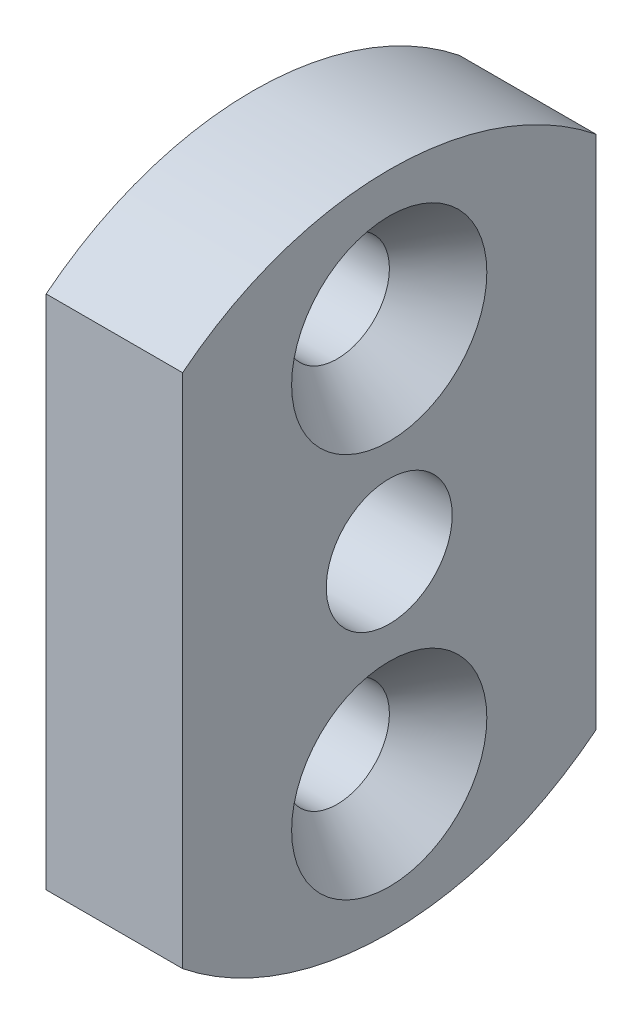
ISO-10303-21;
HEADER;
FILE_DESCRIPTION(('STEP AP214'),'2;1');
FILE_NAME('part.step','',(''),(''),'','','');
FILE_SCHEMA(('AUTOMOTIVE_DESIGN { 1 0 10303 214 1 1 1 1 }'));
ENDSEC;
DATA;
#1=APPLICATION_CONTEXT('core data for automotive mechanical design processes');
#2=APPLICATION_PROTOCOL_DEFINITION('international standard','automotive_design',2000,#1);
#3=PRODUCT_CONTEXT('',#1,'mechanical');
#4=PRODUCT('Part','Part','',(#3));
#5=PRODUCT_RELATED_PRODUCT_CATEGORY('part','',(#4));
#6=PRODUCT_DEFINITION_FORMATION('','',#4);
#7=PRODUCT_DEFINITION_CONTEXT('part definition',#1,'design');
#8=PRODUCT_DEFINITION('design','',#6,#7);
#9=PRODUCT_DEFINITION_SHAPE('','',#8);
#10=(LENGTH_UNIT() NAMED_UNIT(*) SI_UNIT(.MILLI.,.METRE.));
#11=(NAMED_UNIT(*) PLANE_ANGLE_UNIT() SI_UNIT($,.RADIAN.));
#12=(NAMED_UNIT(*) SI_UNIT($,.STERADIAN.) SOLID_ANGLE_UNIT());
#13=UNCERTAINTY_MEASURE_WITH_UNIT(LENGTH_MEASURE(1.E-05),#10,'distance_accuracy_value','');
#14=(GEOMETRIC_REPRESENTATION_CONTEXT(3) GLOBAL_UNCERTAINTY_ASSIGNED_CONTEXT((#13)) GLOBAL_UNIT_ASSIGNED_CONTEXT((#10,
#11,#12)) REPRESENTATION_CONTEXT('',''));
#15=CARTESIAN_POINT('',(0.,0.,0.));
#16=DIRECTION('',(0.,0.,1.));
#17=DIRECTION('',(1.,0.,0.));
#18=AXIS2_PLACEMENT_3D('',#15,#16,#17);
#19=CARTESIAN_POINT('',(4.953,0.,0.));
#20=DIRECTION('',(-1.,0.,0.));
#21=DIRECTION('',(0.,0.,1.));
#22=AXIS2_PLACEMENT_3D('',#19,#20,#21);
#23=PLANE('',#22);
#24=CARTESIAN_POINT('',(4.953,-7.,0.));
#25=DIRECTION('',(1.,0.,0.));
#26=DIRECTION('',(0.,0.,-1.));
#27=AXIS2_PLACEMENT_3D('',#24,#25,#26);
#28=CIRCLE('',#27,3.5433);
#29=CARTESIAN_POINT('',(4.953,-7.,-3.5433));
#30=VERTEX_POINT('',#29);
#31=EDGE_CURVE('E185',#30,#30,#28,.T.);
#32=ORIENTED_EDGE('',*,*,#31,.F.);
#33=EDGE_LOOP('',(#32));
#34=FACE_BOUND('',#33,.T.);
#35=CARTESIAN_POINT('',(4.953,7.,0.));
#36=DIRECTION('',(1.,0.,0.));
#37=DIRECTION('',(0.,0.,-1.));
#38=AXIS2_PLACEMENT_3D('',#35,#36,#37);
#39=CIRCLE('',#38,3.5433);
#40=CARTESIAN_POINT('',(4.953,7.,-3.5433));
#41=VERTEX_POINT('',#40);
#42=EDGE_CURVE('E117',#41,#41,#39,.T.);
#43=ORIENTED_EDGE('',*,*,#42,.F.);
#44=EDGE_LOOP('',(#43));
#45=FACE_BOUND('',#44,.T.);
#46=CARTESIAN_POINT('',(4.953,0.,0.));
#47=DIRECTION('',(1.,0.,0.));
#48=DIRECTION('',(0.,0.,1.));
#49=AXIS2_PLACEMENT_3D('',#46,#47,#48);
#50=CIRCLE('',#49,12.);
#51=CARTESIAN_POINT('',(4.953,9.3674969975976,-7.5));
#52=VERTEX_POINT('',#51);
#53=CARTESIAN_POINT('',(4.953,9.3674969975976,7.5));
#54=VERTEX_POINT('',#53);
#55=EDGE_CURVE('E87',#52,#54,#50,.T.);
#56=ORIENTED_EDGE('',*,*,#55,.T.);
#57=DIRECTION('',(0.,-1.,0.));
#58=VECTOR('',#57,1.);
#59=CARTESIAN_POINT('',(4.953,9.3674969975976,7.5));
#60=LINE('',#59,#58);
#61=CARTESIAN_POINT('',(4.953,-9.3674969975976,7.5));
#62=VERTEX_POINT('',#61);
#63=EDGE_CURVE('E82',#54,#62,#60,.T.);
#64=ORIENTED_EDGE('',*,*,#63,.T.);
#65=CARTESIAN_POINT('',(4.953,0.,0.));
#66=DIRECTION('',(1.,0.,0.));
#67=DIRECTION('',(0.,0.,-1.));
#68=AXIS2_PLACEMENT_3D('',#65,#66,#67);
#69=CIRCLE('',#68,12.);
#70=CARTESIAN_POINT('',(4.953,-9.3674969975976,-7.5));
#71=VERTEX_POINT('',#70);
#72=EDGE_CURVE('E85',#62,#71,#69,.T.);
#73=ORIENTED_EDGE('',*,*,#72,.T.);
#74=DIRECTION('',(0.,1.,0.));
#75=VECTOR('',#74,1.);
#76=CARTESIAN_POINT('',(4.953,9.3674969975976,-7.5));
#77=LINE('',#76,#75);
#78=EDGE_CURVE('E52',#71,#52,#77,.T.);
#79=ORIENTED_EDGE('',*,*,#78,.T.);
#80=EDGE_LOOP('',(#56,#64,#73,#79));
#81=FACE_BOUND('',#80,.T.);
#82=CARTESIAN_POINT('',(4.953,0.,0.));
#83=DIRECTION('',(1.,0.,0.));
#84=DIRECTION('',(0.,0.,-1.));
#85=AXIS2_PLACEMENT_3D('',#82,#83,#84);
#86=CIRCLE('',#85,2.286);
#87=CARTESIAN_POINT('',(4.953,0.,-2.286));
#88=VERTEX_POINT('',#87);
#89=EDGE_CURVE('E103',#88,#88,#86,.T.);
#90=ORIENTED_EDGE('',*,*,#89,.F.);
#91=EDGE_LOOP('',(#90));
#92=FACE_BOUND('',#91,.T.);
#93=ADVANCED_FACE('F33',(#34,#45,#81,#92),#23,.F.);
#94=CARTESIAN_POINT('',(0.,0.,0.));
#95=DIRECTION('',(-1.,0.,0.));
#96=DIRECTION('',(0.,0.,1.));
#97=AXIS2_PLACEMENT_3D('',#94,#95,#96);
#98=PLANE('',#97);
#99=CARTESIAN_POINT('',(0.,-7.,0.));
#100=DIRECTION('',(-1.,0.,0.));
#101=DIRECTION('',(0.,0.,1.));
#102=AXIS2_PLACEMENT_3D('',#99,#100,#101);
#103=CIRCLE('',#102,1.89865);
#104=CARTESIAN_POINT('',(0.,-7.,1.89865));
#105=VERTEX_POINT('',#104);
#106=EDGE_CURVE('E37',#105,#105,#103,.T.);
#107=ORIENTED_EDGE('',*,*,#106,.F.);
#108=EDGE_LOOP('',(#107));
#109=FACE_BOUND('',#108,.T.);
#110=CARTESIAN_POINT('',(0.,7.,0.));
#111=DIRECTION('',(-1.,0.,0.));
#112=DIRECTION('',(0.,0.,1.));
#113=AXIS2_PLACEMENT_3D('',#110,#111,#112);
#114=CIRCLE('',#113,1.89865);
#115=CARTESIAN_POINT('',(0.,7.,1.89865));
#116=VERTEX_POINT('',#115);
#117=EDGE_CURVE('E108',#116,#116,#114,.T.);
#118=ORIENTED_EDGE('',*,*,#117,.F.);
#119=EDGE_LOOP('',(#118));
#120=FACE_BOUND('',#119,.T.);
#121=CARTESIAN_POINT('',(0.,0.,0.));
#122=DIRECTION('',(1.,0.,0.));
#123=DIRECTION('',(0.,0.,1.));
#124=AXIS2_PLACEMENT_3D('',#121,#122,#123);
#125=CIRCLE('',#124,12.);
#126=CARTESIAN_POINT('',(0.,9.3674969975976,-7.5));
#127=VERTEX_POINT('',#126);
#128=CARTESIAN_POINT('',(0.,9.3674969975976,7.5));
#129=VERTEX_POINT('',#128);
#130=EDGE_CURVE('E100',#127,#129,#125,.T.);
#131=ORIENTED_EDGE('',*,*,#130,.F.);
#132=DIRECTION('',(0.,1.,0.));
#133=VECTOR('',#132,1.);
#134=CARTESIAN_POINT('',(0.,9.3674969975976,-7.5));
#135=LINE('',#134,#133);
#136=CARTESIAN_POINT('',(0.,-9.3674969975976,-7.5));
#137=VERTEX_POINT('',#136);
#138=EDGE_CURVE('E75',#137,#127,#135,.T.);
#139=ORIENTED_EDGE('',*,*,#138,.F.);
#140=CARTESIAN_POINT('',(0.,0.,0.));
#141=DIRECTION('',(1.,0.,0.));
#142=DIRECTION('',(0.,0.,-1.));
#143=AXIS2_PLACEMENT_3D('',#140,#141,#142);
#144=CIRCLE('',#143,12.);
#145=CARTESIAN_POINT('',(0.,-9.3674969975976,7.5));
#146=VERTEX_POINT('',#145);
#147=EDGE_CURVE('E69',#146,#137,#144,.T.);
#148=ORIENTED_EDGE('',*,*,#147,.F.);
#149=DIRECTION('',(0.,-1.,0.));
#150=VECTOR('',#149,1.);
#151=CARTESIAN_POINT('',(0.,9.3674969975976,7.5));
#152=LINE('',#151,#150);
#153=EDGE_CURVE('E91',#129,#146,#152,.T.);
#154=ORIENTED_EDGE('',*,*,#153,.F.);
#155=EDGE_LOOP('',(#131,#139,#148,#154));
#156=FACE_BOUND('',#155,.T.);
#157=CARTESIAN_POINT('',(0.,0.,0.));
#158=DIRECTION('',(1.,0.,0.));
#159=DIRECTION('',(0.,0.,-1.));
#160=AXIS2_PLACEMENT_3D('',#157,#158,#159);
#161=CIRCLE('',#160,2.286);
#162=CARTESIAN_POINT('',(0.,0.,-2.286));
#163=VERTEX_POINT('',#162);
#164=EDGE_CURVE('E110',#163,#163,#161,.T.);
#165=ORIENTED_EDGE('',*,*,#164,.T.);
#166=EDGE_LOOP('',(#165));
#167=FACE_BOUND('',#166,.T.);
#168=ADVANCED_FACE('F131',(#109,#120,#156,#167),#98,.T.);
#169=CARTESIAN_POINT('',(4.953,0.,0.));
#170=DIRECTION('',(-1.,0.,0.));
#171=DIRECTION('',(0.,0.,1.));
#172=AXIS2_PLACEMENT_3D('',#169,#170,#171);
#173=CYLINDRICAL_SURFACE('',#172,12.);
#174=ORIENTED_EDGE('',*,*,#130,.T.);
#175=DIRECTION('',(-1.,0.,0.));
#176=VECTOR('',#175,1.);
#177=CARTESIAN_POINT('',(4.953,9.3674969975976,7.5));
#178=LINE('',#177,#176);
#179=EDGE_CURVE('E11',#54,#129,#178,.T.);
#180=ORIENTED_EDGE('',*,*,#179,.F.);
#181=ORIENTED_EDGE('',*,*,#55,.F.);
#182=DIRECTION('',(-1.,0.,0.));
#183=VECTOR('',#182,1.);
#184=CARTESIAN_POINT('',(4.953,9.3674969975976,-7.5));
#185=LINE('',#184,#183);
#186=EDGE_CURVE('E96',#52,#127,#185,.T.);
#187=ORIENTED_EDGE('',*,*,#186,.T.);
#188=EDGE_LOOP('',(#174,#180,#181,#187));
#189=FACE_BOUND('',#188,.T.);
#190=ADVANCED_FACE('F35',(#189),#173,.T.);
#191=CARTESIAN_POINT('',(4.953,9.3674969975976,7.5));
#192=DIRECTION('',(0.,0.,-1.));
#193=DIRECTION('',(-1.,0.,0.));
#194=AXIS2_PLACEMENT_3D('',#191,#192,#193);
#195=PLANE('',#194);
#196=ORIENTED_EDGE('',*,*,#153,.T.);
#197=DIRECTION('',(-1.,0.,0.));
#198=VECTOR('',#197,1.);
#199=CARTESIAN_POINT('',(4.953,-9.3674969975976,7.5));
#200=LINE('',#199,#198);
#201=EDGE_CURVE('E43',#62,#146,#200,.T.);
#202=ORIENTED_EDGE('',*,*,#201,.F.);
#203=ORIENTED_EDGE('',*,*,#63,.F.);
#204=ORIENTED_EDGE('',*,*,#179,.T.);
#205=EDGE_LOOP('',(#196,#202,#203,#204));
#206=FACE_BOUND('',#205,.T.);
#207=ADVANCED_FACE('F90',(#206),#195,.F.);
#208=CARTESIAN_POINT('',(4.953,0.,0.));
#209=DIRECTION('',(-1.,0.,0.));
#210=DIRECTION('',(0.,0.,1.));
#211=AXIS2_PLACEMENT_3D('',#208,#209,#210);
#212=CYLINDRICAL_SURFACE('',#211,12.);
#213=ORIENTED_EDGE('',*,*,#147,.T.);
#214=DIRECTION('',(-1.,0.,0.));
#215=VECTOR('',#214,1.);
#216=CARTESIAN_POINT('',(4.953,-9.3674969975976,-7.5));
#217=LINE('',#216,#215);
#218=EDGE_CURVE('E92',#71,#137,#217,.T.);
#219=ORIENTED_EDGE('',*,*,#218,.F.);
#220=ORIENTED_EDGE('',*,*,#72,.F.);
#221=ORIENTED_EDGE('',*,*,#201,.T.);
#222=EDGE_LOOP('',(#213,#219,#220,#221));
#223=FACE_BOUND('',#222,.T.);
#224=ADVANCED_FACE('F94',(#223),#212,.T.);
#225=CARTESIAN_POINT('',(4.953,9.3674969975976,-7.5));
#226=DIRECTION('',(0.,0.,1.));
#227=DIRECTION('',(1.,0.,0.));
#228=AXIS2_PLACEMENT_3D('',#225,#226,#227);
#229=PLANE('',#228);
#230=ORIENTED_EDGE('',*,*,#138,.T.);
#231=ORIENTED_EDGE('',*,*,#186,.F.);
#232=ORIENTED_EDGE('',*,*,#78,.F.);
#233=ORIENTED_EDGE('',*,*,#218,.T.);
#234=EDGE_LOOP('',(#230,#231,#232,#233));
#235=FACE_BOUND('',#234,.T.);
#236=ADVANCED_FACE('F144',(#235),#229,.F.);
#237=CARTESIAN_POINT('',(4.953,0.,0.));
#238=DIRECTION('',(-1.,0.,0.));
#239=DIRECTION('',(0.,0.,1.));
#240=AXIS2_PLACEMENT_3D('',#237,#238,#239);
#241=CYLINDRICAL_SURFACE('',#240,2.286);
#242=ORIENTED_EDGE('',*,*,#89,.T.);
#243=EDGE_LOOP('',(#242));
#244=FACE_BOUND('',#243,.T.);
#245=ORIENTED_EDGE('',*,*,#164,.F.);
#246=EDGE_LOOP('',(#245));
#247=FACE_BOUND('',#246,.T.);
#248=ADVANCED_FACE('F128',(#244,#247),#241,.F.);
#249=CARTESIAN_POINT('',(4.953,7.,0.));
#250=DIRECTION('',(1.,0.,0.));
#251=DIRECTION('',(0.,0.,-1.));
#252=AXIS2_PLACEMENT_3D('',#249,#250,#251);
#253=CYLINDRICAL_SURFACE('',#252,1.89865);
#254=ORIENTED_EDGE('',*,*,#117,.T.);
#255=EDGE_LOOP('',(#254));
#256=FACE_BOUND('',#255,.T.);
#257=CARTESIAN_POINT('',(3.06104659906397,7.,0.));
#258=DIRECTION('',(1.,0.,0.));
#259=DIRECTION('',(0.,0.,-1.));
#260=AXIS2_PLACEMENT_3D('',#257,#258,#259);
#261=CIRCLE('',#260,1.89865);
#262=CARTESIAN_POINT('',(3.06104659906397,7.,-1.89865));
#263=VERTEX_POINT('',#262);
#264=EDGE_CURVE('E111',#263,#263,#261,.T.);
#265=ORIENTED_EDGE('',*,*,#264,.T.);
#266=EDGE_LOOP('',(#265));
#267=FACE_BOUND('',#266,.T.);
#268=ADVANCED_FACE('F160',(#256,#267),#253,.F.);
#269=CARTESIAN_POINT('',(4.953,7.,0.));
#270=DIRECTION('',(1.,0.,0.));
#271=DIRECTION('',(0.,0.,-1.));
#272=AXIS2_PLACEMENT_3D('',#269,#270,#271);
#273=CONICAL_SURFACE('',#272,3.5433,0.715584993317676);
#274=ORIENTED_EDGE('',*,*,#264,.F.);
#275=EDGE_LOOP('',(#274));
#276=FACE_BOUND('',#275,.T.);
#277=ORIENTED_EDGE('',*,*,#42,.T.);
#278=EDGE_LOOP('',(#277));
#279=FACE_BOUND('',#278,.T.);
#280=ADVANCED_FACE('F164',(#276,#279),#273,.F.);
#281=CARTESIAN_POINT('',(4.953,-7.,0.));
#282=DIRECTION('',(1.,0.,0.));
#283=DIRECTION('',(0.,0.,-1.));
#284=AXIS2_PLACEMENT_3D('',#281,#282,#283);
#285=CYLINDRICAL_SURFACE('',#284,1.89865);
#286=ORIENTED_EDGE('',*,*,#106,.T.);
#287=EDGE_LOOP('',(#286));
#288=FACE_BOUND('',#287,.T.);
#289=CARTESIAN_POINT('',(3.06104659906397,-7.,0.));
#290=DIRECTION('',(1.,0.,0.));
#291=DIRECTION('',(0.,0.,-1.));
#292=AXIS2_PLACEMENT_3D('',#289,#290,#291);
#293=CIRCLE('',#292,1.89865);
#294=CARTESIAN_POINT('',(3.06104659906397,-7.,-1.89865));
#295=VERTEX_POINT('',#294);
#296=EDGE_CURVE('E183',#295,#295,#293,.T.);
#297=ORIENTED_EDGE('',*,*,#296,.T.);
#298=EDGE_LOOP('',(#297));
#299=FACE_BOUND('',#298,.T.);
#300=ADVANCED_FACE('F168',(#288,#299),#285,.F.);
#301=CARTESIAN_POINT('',(4.953,-7.,0.));
#302=DIRECTION('',(1.,0.,0.));
#303=DIRECTION('',(0.,0.,-1.));
#304=AXIS2_PLACEMENT_3D('',#301,#302,#303);
#305=CONICAL_SURFACE('',#304,3.5433,0.715584993317675);
#306=ORIENTED_EDGE('',*,*,#296,.F.);
#307=EDGE_LOOP('',(#306));
#308=FACE_BOUND('',#307,.T.);
#309=ORIENTED_EDGE('',*,*,#31,.T.);
#310=EDGE_LOOP('',(#309));
#311=FACE_BOUND('',#310,.T.);
#312=ADVANCED_FACE('F174',(#308,#311),#305,.F.);
#313=CLOSED_SHELL('',(#93,#168,#190,#207,#224,#236,#248,#268,#280,#300,#312));
#314=MANIFOLD_SOLID_BREP('B2',#313);
#315=ADVANCED_BREP_SHAPE_REPRESENTATION('',(#18,#314),#14);
#316=SHAPE_DEFINITION_REPRESENTATION(#9,#315);
ENDSEC;
END-ISO-10303-21;
